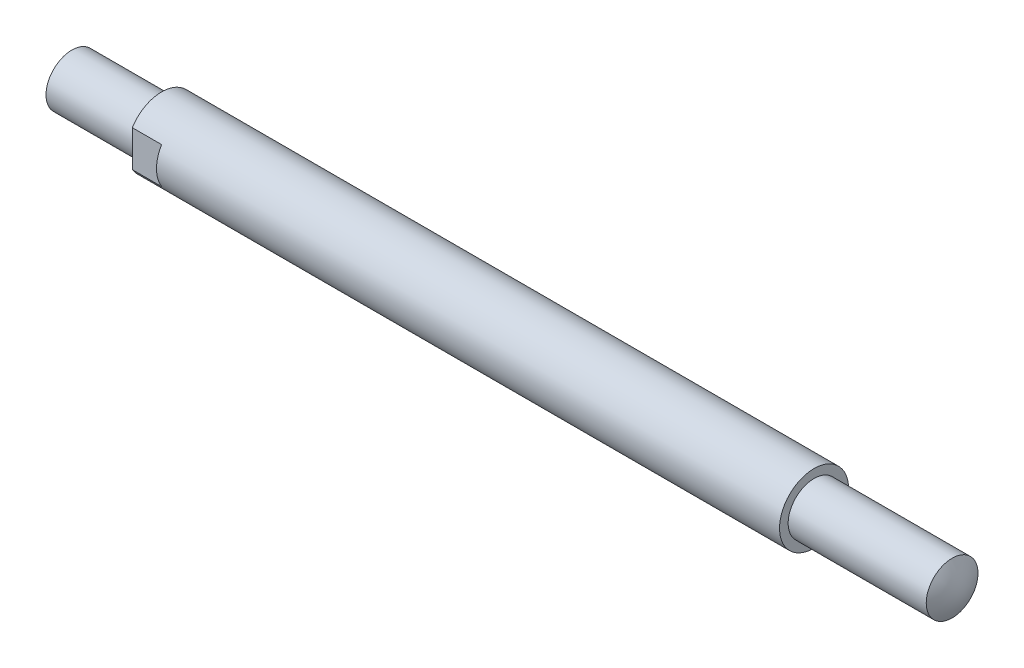
ISO-10303-21;
HEADER;
FILE_DESCRIPTION(('STEP AP214'),'2;1');
FILE_NAME('part.step','',(''),(''),'','','');
FILE_SCHEMA(('AUTOMOTIVE_DESIGN { 1 0 10303 214 1 1 1 1 }'));
ENDSEC;
DATA;
#1=APPLICATION_CONTEXT('core data for automotive mechanical design processes');
#2=APPLICATION_PROTOCOL_DEFINITION('international standard','automotive_design',2000,#1);
#3=PRODUCT_CONTEXT('',#1,'mechanical');
#4=PRODUCT('Part','Part','',(#3));
#5=PRODUCT_RELATED_PRODUCT_CATEGORY('part','',(#4));
#6=PRODUCT_DEFINITION_FORMATION('','',#4);
#7=PRODUCT_DEFINITION_CONTEXT('part definition',#1,'design');
#8=PRODUCT_DEFINITION('design','',#6,#7);
#9=PRODUCT_DEFINITION_SHAPE('','',#8);
#10=(LENGTH_UNIT() NAMED_UNIT(*) SI_UNIT(.MILLI.,.METRE.));
#11=(NAMED_UNIT(*) PLANE_ANGLE_UNIT() SI_UNIT($,.RADIAN.));
#12=(NAMED_UNIT(*) SI_UNIT($,.STERADIAN.) SOLID_ANGLE_UNIT());
#13=UNCERTAINTY_MEASURE_WITH_UNIT(LENGTH_MEASURE(1.E-05),#10,'distance_accuracy_value','');
#14=(GEOMETRIC_REPRESENTATION_CONTEXT(3) GLOBAL_UNCERTAINTY_ASSIGNED_CONTEXT((#13)) GLOBAL_UNIT_ASSIGNED_CONTEXT((#10,
#11,#12)) REPRESENTATION_CONTEXT('',''));
#15=CARTESIAN_POINT('',(0.,0.,0.));
#16=DIRECTION('',(0.,0.,1.));
#17=DIRECTION('',(1.,0.,0.));
#18=AXIS2_PLACEMENT_3D('',#15,#16,#17);
#19=CARTESIAN_POINT('',(0.,0.,0.));
#20=DIRECTION('',(1.,0.,0.));
#21=DIRECTION('',(0.,0.,-1.));
#22=AXIS2_PLACEMENT_3D('',#19,#20,#21);
#23=CYLINDRICAL_SURFACE('',#22,20.);
#24=CARTESIAN_POINT('',(52.,0.,0.));
#25=DIRECTION('',(1.,0.,0.));
#26=DIRECTION('',(0.,0.,-1.));
#27=AXIS2_PLACEMENT_3D('',#24,#25,#26);
#28=CIRCLE('',#27,20.);
#29=CARTESIAN_POINT('',(52.,-10.5356537528528,17.));
#30=VERTEX_POINT('',#29);
#31=CARTESIAN_POINT('',(52.,-10.5356537528527,-17.));
#32=VERTEX_POINT('',#31);
#33=EDGE_CURVE('E128',#30,#32,#28,.T.);
#34=ORIENTED_EDGE('',*,*,#33,.T.);
#35=DIRECTION('',(1.,0.,0.));
#36=VECTOR('',#35,1.);
#37=CARTESIAN_POINT('',(0.,-10.5356537528528,-17.));
#38=LINE('',#37,#36);
#39=CARTESIAN_POINT('',(69.,-10.5356537528528,-17.));
#40=VERTEX_POINT('',#39);
#41=EDGE_CURVE('E161',#32,#40,#38,.T.);
#42=ORIENTED_EDGE('',*,*,#41,.T.);
#43=CARTESIAN_POINT('',(69.,0.,0.));
#44=DIRECTION('',(-1.,0.,0.));
#45=DIRECTION('',(0.,0.,1.));
#46=AXIS2_PLACEMENT_3D('',#43,#44,#45);
#47=CIRCLE('',#46,20.);
#48=CARTESIAN_POINT('',(69.,10.5356537528528,-17.));
#49=VERTEX_POINT('',#48);
#50=EDGE_CURVE('E120',#40,#49,#47,.F.);
#51=ORIENTED_EDGE('',*,*,#50,.T.);
#52=DIRECTION('',(1.,0.,0.));
#53=VECTOR('',#52,1.);
#54=CARTESIAN_POINT('',(0.,10.5356537528528,-17.));
#55=LINE('',#54,#53);
#56=CARTESIAN_POINT('',(52.,10.5356537528527,-17.));
#57=VERTEX_POINT('',#56);
#58=EDGE_CURVE('E159',#49,#57,#55,.F.);
#59=ORIENTED_EDGE('',*,*,#58,.T.);
#60=CARTESIAN_POINT('',(52.,10.5356537528528,17.));
#61=VERTEX_POINT('',#60);
#62=EDGE_CURVE('E135',#57,#61,#28,.T.);
#63=ORIENTED_EDGE('',*,*,#62,.T.);
#64=DIRECTION('',(1.,0.,0.));
#65=VECTOR('',#64,1.);
#66=CARTESIAN_POINT('',(0.,10.5356537528528,17.));
#67=LINE('',#66,#65);
#68=CARTESIAN_POINT('',(69.,10.5356537528528,17.));
#69=VERTEX_POINT('',#68);
#70=EDGE_CURVE('E168',#61,#69,#67,.T.);
#71=ORIENTED_EDGE('',*,*,#70,.T.);
#72=CARTESIAN_POINT('',(69.,-10.5356537528528,17.));
#73=VERTEX_POINT('',#72);
#74=EDGE_CURVE('E13',#69,#73,#47,.F.);
#75=ORIENTED_EDGE('',*,*,#74,.T.);
#76=DIRECTION('',(1.,0.,0.));
#77=VECTOR('',#76,1.);
#78=CARTESIAN_POINT('',(0.,-10.5356537528528,17.));
#79=LINE('',#78,#77);
#80=EDGE_CURVE('E230',#73,#30,#79,.F.);
#81=ORIENTED_EDGE('',*,*,#80,.T.);
#82=EDGE_LOOP('',(#34,#42,#51,#59,#63,#71,#75,#81));
#83=FACE_BOUND('',#82,.T.);
#84=CARTESIAN_POINT('',(430.,0.,0.));
#85=DIRECTION('',(1.,0.,0.));
#86=DIRECTION('',(0.,0.,-1.));
#87=AXIS2_PLACEMENT_3D('',#84,#85,#86);
#88=CIRCLE('',#87,20.0000000000001);
#89=CARTESIAN_POINT('',(430.,0.,-20.0000000000001));
#90=VERTEX_POINT('',#89);
#91=EDGE_CURVE('E172',#90,#90,#88,.T.);
#92=ORIENTED_EDGE('',*,*,#91,.F.);
#93=EDGE_LOOP('',(#92));
#94=FACE_BOUND('',#93,.T.);
#95=ADVANCED_FACE('F104',(#83,#94),#23,.T.);
#96=CARTESIAN_POINT('',(52.,20.,0.));
#97=DIRECTION('',(-1.,0.,0.));
#98=DIRECTION('',(0.,0.,1.));
#99=AXIS2_PLACEMENT_3D('',#96,#97,#98);
#100=PLANE('',#99);
#101=CARTESIAN_POINT('',(52.,0.,0.));
#102=DIRECTION('',(1.,0.,0.));
#103=DIRECTION('',(0.,0.,-1.));
#104=AXIS2_PLACEMENT_3D('',#101,#102,#103);
#105=CIRCLE('',#104,15.);
#106=CARTESIAN_POINT('',(52.,0.,-15.));
#107=VERTEX_POINT('',#106);
#108=EDGE_CURVE('E177',#107,#107,#105,.T.);
#109=ORIENTED_EDGE('',*,*,#108,.T.);
#110=EDGE_LOOP('',(#109));
#111=FACE_BOUND('',#110,.T.);
#112=ORIENTED_EDGE('',*,*,#33,.F.);
#113=DIRECTION('',(0.,1.,0.));
#114=VECTOR('',#113,1.);
#115=CARTESIAN_POINT('',(52.,20.,17.));
#116=LINE('',#115,#114);
#117=EDGE_CURVE('E163',#30,#61,#116,.T.);
#118=ORIENTED_EDGE('',*,*,#117,.T.);
#119=ORIENTED_EDGE('',*,*,#62,.F.);
#120=DIRECTION('',(0.,-1.,0.));
#121=VECTOR('',#120,1.);
#122=CARTESIAN_POINT('',(52.,20.,-17.));
#123=LINE('',#122,#121);
#124=EDGE_CURVE('E156',#57,#32,#123,.T.);
#125=ORIENTED_EDGE('',*,*,#124,.T.);
#126=EDGE_LOOP('',(#112,#118,#119,#125));
#127=FACE_BOUND('',#126,.T.);
#128=ADVANCED_FACE('F171',(#111,#127),#100,.T.);
#129=CARTESIAN_POINT('',(506.003460721565,15.5059468598419,-15.5299512966578));
#130=CARTESIAN_POINT('',(508.510380165606,9.32761405926904,-15.5299512966578));
#131=CARTESIAN_POINT('',(510.649872528677,3.14928125869615,-15.5299512966578));
#132=CARTESIAN_POINT('',(510.690945581682,-3.02905154187674,-15.5299512966578));
#133=CARTESIAN_POINT('',(508.554336804475,-9.2073843424496,-15.5299512966578));
#134=CARTESIAN_POINT('',(505.985256529258,-15.3857171430225,-15.5299512966578));
#135=CARTESIAN_POINT('',(508.533016073227,15.5059468598419,-9.3311533509139));
#136=CARTESIAN_POINT('',(511.479776545677,9.32761405926902,-9.3311533509139));
#137=CARTESIAN_POINT('',(514.31880844939,3.14928125869612,-9.3311533509139));
#138=CARTESIAN_POINT('',(514.39235412393,-3.02905154187676,-9.3311533509139));
#139=CARTESIAN_POINT('',(511.565569706442,-9.20738434244962,-9.3311533509139));
#140=CARTESIAN_POINT('',(508.570988412591,-15.3857171430225,-9.3311533509139));
#141=CARTESIAN_POINT('',(510.67652886431,15.5059468598419,-3.13235540516998));
#142=CARTESIAN_POINT('',(514.321277594549,9.327614059269,-3.13235540516997));
#143=CARTESIAN_POINT('',(517.970062646521,3.14928125869609,-3.13235540516998));
#144=CARTESIAN_POINT('',(518.072751997051,-3.02905154187679,-3.13235540516997));
#145=CARTESIAN_POINT('',(514.457278711764,-9.20738434244965,-3.13235540516998));
#146=CARTESIAN_POINT('',(510.758280108599,-15.3857171430225,-3.13235540516998));
#147=CARTESIAN_POINT('',(510.699473093552,15.5059468598419,3.06644254057395));
#148=CARTESIAN_POINT('',(514.351442665554,9.327614059269,3.06644254057394));
#149=CARTESIAN_POINT('',(518.037439853943,3.14928125869609,3.06644254057395));
#150=CARTESIAN_POINT('',(518.143550381017,-3.02905154187679,3.06644254057394));
#151=CARTESIAN_POINT('',(514.486706585811,-9.20738434244965,3.06644254057395));
#152=CARTESIAN_POINT('',(510.781993088006,-15.3857171430225,3.06644254057395));
#153=CARTESIAN_POINT('',(508.557805894513,15.5059468598419,9.26524048631787));
#154=CARTESIAN_POINT('',(511.531916569572,9.32761405926902,9.26524048631787));
#155=CARTESIAN_POINT('',(514.386604159846,3.14928125869612,9.26524048631787));
#156=CARTESIAN_POINT('',(514.46032875222,-3.02905154187676,9.26524048631787));
#157=CARTESIAN_POINT('',(511.619019722273,-9.20738434244962,9.26524048631787));
#158=CARTESIAN_POINT('',(508.596532801838,-15.3857171430225,9.26524048631787));
#159=CARTESIAN_POINT('',(505.992208009904,15.5059468598419,15.4640384320618));
#160=CARTESIAN_POINT('',(508.528942767858,9.32761405926904,15.4640384320618));
#161=CARTESIAN_POINT('',(510.696356511559,3.14928125869615,15.4640384320618));
#162=CARTESIAN_POINT('',(510.737951916131,-3.02905154187674,15.4640384320618));
#163=CARTESIAN_POINT('',(508.573826094818,-9.2073843424496,15.4640384320618));
#164=CARTESIAN_POINT('',(505.974647044061,-15.3857171430225,15.4640384320618));
#165=B_SPLINE_SURFACE_WITH_KNOTS('',5,5,((#129,#130,#131,#132,#133,#134),(#135,#136,#137,#138,
#139,#140),(#141,#142,#143,#144,#145,#146),(#147,#148,#149,#150,#151,#152),(#153,#154,#155,#156,
#157,#158),(#159,#160,#161,#162,#163,#164)),.UNSPECIFIED.,.F.,.F.,.F.,(6,6),(6,6),
(-14.8156655821278,16.1783241465919),(-15.5059468598419,15.3857171430225),.UNSPECIFIED.);
#166=CARTESIAN_POINT('',(510.000496568832,-1.31570145403548E-09,15.));
#167=CARTESIAN_POINT('',(510.000495782168,-0.421429776869079,15.0000030242873));
#168=CARTESIAN_POINT('',(510.000450512711,-0.842809923144413,14.9822323929808));
#169=CARTESIAN_POINT('',(510.000293100361,-1.68271575973997,14.9112739255239));
#170=CARTESIAN_POINT('',(510.000180939876,-2.10124066985293,14.858076771977));
#171=CARTESIAN_POINT('',(509.999941224686,-2.93276539985645,14.7165539633599));
#172=CARTESIAN_POINT('',(509.999813653539,-3.34575878690115,14.628190553682));
#173=CARTESIAN_POINT('',(509.999603605112,-4.16282768385486,14.4169661718588));
#174=CARTESIAN_POINT('',(509.999521127667,-4.5669032260511,14.2941053246342));
#175=CARTESIAN_POINT('',(509.99944253143,-5.36306649444973,14.0148279189499));
#176=CARTESIAN_POINT('',(509.999446370848,-5.75515992951628,13.8584276343539));
#177=CARTESIAN_POINT('',(509.999543787928,-6.52478193673851,13.5131457176007));
#178=CARTESIAN_POINT('',(509.999637367008,-6.90231027868234,13.3242635723015));
#179=CARTESIAN_POINT('',(509.999877918974,-7.6400164834715,12.9154150147954));
#180=CARTESIAN_POINT('',(510.000024878246,-8.00019874346059,12.695456536489));
#181=CARTESIAN_POINT('',(510.000311713865,-8.7007543682273,12.2259833328527));
#182=CARTESIAN_POINT('',(510.000451590241,-9.04112781053462,11.9764687232142));
#183=CARTESIAN_POINT('',(510.000665885931,-9.699682991689,11.449628059589));
#184=CARTESIAN_POINT('',(510.000740298305,-10.0178623745999,11.1722990606532));
#185=CARTESIAN_POINT('',(510.00079272345,-10.629728114431,10.5918229523592));
#186=CARTESIAN_POINT('',(510.000770736122,-10.9234144466755,10.288675816991));
#187=CARTESIAN_POINT('',(510.000640247796,-11.4842168001909,9.65870651515304));
#188=CARTESIAN_POINT('',(510.000531743429,-11.75133178657,9.33188342741649));
#189=CARTESIAN_POINT('',(510.000274368157,-12.2570793034053,8.65689632371608));
#190=CARTESIAN_POINT('',(510.000125497259,-12.4957118391047,8.30873231168075));
#191=CARTESIAN_POINT('',(509.999849517643,-12.9427935954912,7.59354555201252));
#192=CARTESIAN_POINT('',(509.999722408503,-13.1512434009711,7.22652316994863));
#193=CARTESIAN_POINT('',(509.999541059274,-13.5364832538559,6.47622275914334));
#194=CARTESIAN_POINT('',(509.999486819184,-13.7132733011784,6.09294473035961));
#195=CARTESIAN_POINT('',(509.999469505286,-14.0339364308345,5.31285870857865));
#196=CARTESIAN_POINT('',(509.999506431293,-14.1778095799308,4.91605074302493));
#197=CARTESIAN_POINT('',(509.99964977733,-14.4316165244403,4.11172517236712));
#198=CARTESIAN_POINT('',(509.999756197361,-14.5415503193728,3.70420756711135));
#199=CARTESIAN_POINT('',(509.999987296172,-14.7266971737909,2.88135912672158));
#200=CARTESIAN_POINT('',(510.000111974986,-14.8019101675327,2.46602827679474));
#201=CARTESIAN_POINT('',(510.000321946595,-14.9170803954478,1.63050683442831));
#202=CARTESIAN_POINT('',(510.00040723939,-14.9570376300679,1.21031624205031));
#203=CARTESIAN_POINT('',(510.000499980171,-15.0014122262983,0.368063371225103));
#204=CARTESIAN_POINT('',(510.000507428299,-15.0058296520966,-0.0539989038403074));
#205=CARTESIAN_POINT('',(510.000442029274,-14.9790933935277,-0.89699528541269));
#206=CARTESIAN_POINT('',(510.000369182121,-14.947939708907,-1.31792939191162));
#207=CARTESIAN_POINT('',(510.000177586901,-14.8502826752609,-2.15567719831753));
#208=CARTESIAN_POINT('',(510.000058838797,-14.7837792972272,-2.57249089484298));
#209=CARTESIAN_POINT('',(509.999831386751,-14.6158956555096,-3.39903425987463));
#210=CARTESIAN_POINT('',(509.999722682809,-14.5145153918561,-3.80876392838702));
#211=CARTESIAN_POINT('',(509.999568233754,-14.2775986003683,-4.61822674793146));
#212=CARTESIAN_POINT('',(509.999522488706,-14.1420620368804,-5.01795988852829));
#213=CARTESIAN_POINT('',(509.999520719655,-13.8377962831581,-5.80458733431049));
#214=CARTESIAN_POINT('',(509.999564695652,-13.6690670930451,-6.19148163954285));
#215=CARTESIAN_POINT('',(509.999731246348,-13.2996156849929,-6.94968076024351));
#216=CARTESIAN_POINT('',(509.999853821035,-13.0988934718615,-7.32098557805453));
#217=CARTESIAN_POINT('',(510.000133089784,-12.6668830116574,-8.04536604493487));
#218=CARTESIAN_POINT('',(510.000289783847,-12.4355947642874,-8.39844169382688));
#219=CARTESIAN_POINT('',(510.000578064608,-11.9440966460005,-9.08385354275871));
#220=CARTESIAN_POINT('',(510.000709651317,-11.6838867871645,-9.41618975146153));
#221=CARTESIAN_POINT('',(510.000898298053,-11.1363952937417,-10.0577601752451));
#222=CARTESIAN_POINT('',(510.000955358079,-10.8491136595269,-10.3669943906432));
#223=CARTESIAN_POINT('',(510.000975344769,-10.2495208144079,-10.9601625538559));
#224=CARTESIAN_POINT('',(510.000938271368,-9.93720958663945,-11.2440964846233));
#225=CARTESIAN_POINT('',(510.000787323274,-9.28977807669831,-11.7846452394455));
#226=CARTESIAN_POINT('',(510.000673448579,-8.95465779420935,-12.0412600631214));
#227=CARTESIAN_POINT('',(510.000414741853,-8.26399062395911,-12.5253462684726));
#228=CARTESIAN_POINT('',(510.000269909816,-7.90844373295149,-12.7528176455162));
#229=CARTESIAN_POINT('',(510.000003650543,-7.17945110444733,-13.1769997347818));
#230=CARTESIAN_POINT('',(509.999882223305,-6.80600536710162,-13.373710447263));
#231=CARTESIAN_POINT('',(509.999702893089,-6.04387006453483,-13.7349726891682));
#232=CARTESIAN_POINT('',(509.999644990101,-5.65518050153236,-13.8995242232727));
#233=CARTESIAN_POINT('',(509.999602813841,-4.86532085200752,-14.1952982760807));
#234=CARTESIAN_POINT('',(509.99961854057,-4.46415076544377,-14.3265207946738));
#235=CARTESIAN_POINT('',(509.999701465445,-3.65218217173066,-14.5547038963421));
#236=CARTESIAN_POINT('',(509.99976866359,-3.24138366496137,-14.6516644807698));
#237=CARTESIAN_POINT('',(509.999911955852,-2.41307873900609,-14.8106343929116));
#238=CARTESIAN_POINT('',(509.999988049968,-1.99557231981585,-14.8726437206035));
#239=CARTESIAN_POINT('',(510.000106559908,-1.15681984449906,-14.9612702640277));
#240=CARTESIAN_POINT('',(510.000148975737,-0.735573788956972,-14.9878874852911));
#241=CARTESIAN_POINT('',(510.000177389449,0.10766321599408,-15.0055406000806));
#242=CARTESIAN_POINT('',(510.000163387332,0.529654165400681,-14.9965764937196));
#243=CARTESIAN_POINT('',(510.000086520521,1.37138087016554,-14.9431306824296));
#244=CARTESIAN_POINT('',(510.000023655825,1.79111662543291,-14.8986489760691));
#245=CARTESIAN_POINT('',(509.999883393547,2.62534886388983,-14.7744842016327));
#246=CARTESIAN_POINT('',(509.999805995966,3.03984534705022,-14.6948011333608));
#247=CARTESIAN_POINT('',(509.999681834796,3.8606523673397,-14.5008000985664));
#248=CARTESIAN_POINT('',(509.999635071217,4.26696290172348,-14.3864821204287));
#249=CARTESIAN_POINT('',(509.999606888594,5.0685092527236,-14.1240240071999));
#250=CARTESIAN_POINT('',(509.999625469548,5.46374506943249,-13.9758838723915));
#251=CARTESIAN_POINT('',(509.999735073728,6.240332041305,-13.646834657578));
#252=CARTESIAN_POINT('',(509.999826096945,6.62168319814964,-13.4659255815402));
#253=CARTESIAN_POINT('',(510.000054841145,7.36778972678952,-13.0726246290949));
#254=CARTESIAN_POINT('',(510.000192562129,7.73254509841001,-12.8602327523558));
#255=CARTESIAN_POINT('',(510.000465462221,8.44286662991595,-12.4054763297013));
#256=CARTESIAN_POINT('',(510.000600641331,8.7884328031267,-12.1631118045997));
#257=CARTESIAN_POINT('',(510.000815917578,9.45791945564833,-11.6501330236194));
#258=CARTESIAN_POINT('',(510.000896014716,9.78183993522586,-11.3795187680888));
#259=CARTESIAN_POINT('',(510.000967743036,10.4057324438237,-10.811964315307));
#260=CARTESIAN_POINT('',(510.000959374184,10.7057044634857,-10.5150241077686));
#261=CARTESIAN_POINT('',(510.000854888972,11.2795672812808,-9.89692891757377));
#262=CARTESIAN_POINT('',(510.000758772612,11.5534580791856,-9.57577393470545));
#263=CARTESIAN_POINT('',(510.000514338933,12.0732111484605,-8.91153255400209));
#264=CARTESIAN_POINT('',(510.000366021635,12.3190734312243,-8.5684461650824));
#265=CARTESIAN_POINT('',(510.000073411925,12.7810216817727,-7.86278097468131));
#266=CARTESIAN_POINT('',(509.999929119512,12.9971076496474,-7.50020217325885));
#267=CARTESIAN_POINT('',(509.999698255497,13.3979668240505,-6.75813025125523));
#268=CARTESIAN_POINT('',(509.999611683833,13.5827400641289,-6.37863714879741));
#269=CARTESIAN_POINT('',(509.999525025022,13.9196604357371,-5.6054342271989));
#270=CARTESIAN_POINT('',(509.999524937874,14.071807567448,-5.21172440813714));
#271=CARTESIAN_POINT('',(509.999603180308,14.3423941139983,-4.412886898617));
#272=CARTESIAN_POINT('',(509.999681509929,14.4608335120972,-4.00775920248817));
#273=CARTESIAN_POINT('',(509.999875567466,14.6631624642494,-3.18896632859569));
#274=CARTESIAN_POINT('',(509.999991295383,14.7470520178933,-2.77530115073084));
#275=CARTESIAN_POINT('',(510.000204320831,14.8796850008568,-1.94237344824624));
#276=CARTESIAN_POINT('',(510.000301618329,14.9284283664829,-1.5231109134841));
#277=CARTESIAN_POINT('',(510.000431767293,14.9904221870316,-0.681969936841834));
#278=CARTESIAN_POINT('',(510.000464618761,15.0036726423846,-0.260091494993431));
#279=CARTESIAN_POINT('',(510.000450060028,14.9945864454591,0.583281375101778));
#280=CARTESIAN_POINT('',(510.000402649943,14.9722498445521,1.00477580390205));
#281=CARTESIAN_POINT('',(510.00024909389,14.8921484331079,1.84438468882242));
#282=CARTESIAN_POINT('',(510.000142947922,14.8343836220447,2.26249914489233));
#283=CARTESIAN_POINT('',(509.99992138757,14.6838363105082,3.09237639179817));
#284=CARTESIAN_POINT('',(509.999805973169,14.5910537393596,3.50413916981293));
#285=CARTESIAN_POINT('',(509.999621305243,14.3711305472891,4.3183848056189));
#286=CARTESIAN_POINT('',(509.999552051716,14.2439899274296,4.72086766369708));
#287=CARTESIAN_POINT('',(509.999496112815,13.9562518490919,5.51369943734836));
#288=CARTESIAN_POINT('',(509.999509428977,13.7956537679761,5.90404812695131));
#289=CARTESIAN_POINT('',(509.999619088272,13.4421439698432,6.66982853832799));
#290=CARTESIAN_POINT('',(509.999715431423,13.2492322462101,7.04526025704756));
#291=CARTESIAN_POINT('',(509.99995441308,12.8324748533716,7.77852315920301));
#292=CARTESIAN_POINT('',(510.000097049785,12.6086303881585,8.13635502694163));
#293=CARTESIAN_POINT('',(510.000369997701,12.1315933669637,8.83188968329564));
#294=CARTESIAN_POINT('',(510.000500308924,11.8784008408227,9.16959249237739));
#295=CARTESIAN_POINT('',(510.0006933482,11.3444959570048,9.82243384288976));
#296=CARTESIAN_POINT('',(510.000756083454,11.0637865347708,10.1375747849786));
#297=CARTESIAN_POINT('',(510.000786352805,10.4768193224881,10.7430932910728));
#298=CARTESIAN_POINT('',(510.00075388653,10.1705614326079,11.033470758305));
#299=CARTESIAN_POINT('',(510.000606114518,9.53459380052233,11.5874677113883));
#300=CARTESIAN_POINT('',(510.000490787663,9.20487809951162,11.8510803568078));
#301=CARTESIAN_POINT('',(510.000224742064,8.5244143789643,12.349584679771));
#302=CARTESIAN_POINT('',(510.000074023878,8.17366669140515,12.5844768104733));
#303=CARTESIAN_POINT('',(509.999799267841,7.45345349370539,13.023981064997));
#304=CARTESIAN_POINT('',(509.999675242927,7.08397901480491,13.2285784923822));
#305=CARTESIAN_POINT('',(509.999503891636,6.32909940222618,13.6059017034148));
#306=CARTESIAN_POINT('',(509.999456565535,5.94369421106865,13.7786273720541));
#307=CARTESIAN_POINT('',(509.999454530555,5.16011071944589,14.0908095850588));
#308=CARTESIAN_POINT('',(509.999499722133,4.76194660044433,14.2303017061891));
#309=CARTESIAN_POINT('',(509.999657878446,3.95541951906799,14.4752296062212));
#310=CARTESIAN_POINT('',(509.999770825353,3.54705926671651,14.5806743329027));
#311=CARTESIAN_POINT('',(510.000040213952,2.62023991534775,14.7787428493112));
#312=CARTESIAN_POINT('',(510.000200484451,2.09967450591842,14.861643863909));
#313=CARTESIAN_POINT('',(510.000429153118,1.0527135945674,14.9722705501253));
#314=CARTESIAN_POINT('',(510.000497551288,0.526318092779256,14.9999962230076));
#315=CARTESIAN_POINT('',(510.000496568832,-1.31570145403548E-09,15.));
#316=B_SPLINE_CURVE_WITH_KNOTS('',3,(#166,#167,#168,#169,#170,#171,#172,#173,#174,#175,#176,
#177,#178,#179,#180,#181,#182,#183,#184,#185,#186,#187,#188,#189,#190,#191,#192,#193,#194,#195,
#196,#197,#198,#199,#200,#201,#202,#203,#204,#205,#206,#207,#208,#209,#210,#211,#212,#213,#214,
#215,#216,#217,#218,#219,#220,#221,#222,#223,#224,#225,#226,#227,#228,#229,#230,#231,#232,#233,
#234,#235,#236,#237,#238,#239,#240,#241,#242,#243,#244,#245,#246,#247,#248,#249,#250,#251,#252,
#253,#254,#255,#256,#257,#258,#259,#260,#261,#262,#263,#264,#265,#266,#267,#268,#269,#270,#271,
#272,#273,#274,#275,#276,#277,#278,#279,#280,#281,#282,#283,#284,#285,#286,#287,#288,#289,#290,
#291,#292,#293,#294,#295,#296,#297,#298,#299,#300,#301,#302,#303,#304,#305,#306,#307,#308,#309,
#310,#311,#312,#313,#314,#315),.UNSPECIFIED.,.T.,.F.,(4,2,2,2,2,2,2,2,2,2,2,2,2,2,2,2,2,2,2,2,2,
2,2,2,2,2,2,2,2,2,2,2,2,2,2,2,2,2,2,2,2,2,2,2,2,2,2,2,2,2,2,2,2,2,2,2,2,2,2,2,2,2,2,2,2,2,2,2,2,
2,2,2,2,2,4),(0.,1.26382958854519,2.52799170350713,3.79351470426992,5.05903312242915,
6.32393887489262,7.58886461192347,8.85346799043871,10.1180664190913,11.3827988833182,
12.6475326216952,13.9123155992231,15.1770983439246,16.4418565800875,17.7066148195441,
18.9713704937743,20.236126185917,21.5008842728642,22.7656423437809,24.030398130434,
25.2951539261045,26.5599107596503,27.8246675920909,29.0894257447363,30.354183892754,
31.6189418507084,32.8836998209647,34.1484572629189,35.4132146874929,36.6779729642397,
37.9427312585242,39.2074897538127,40.4722482384426,41.7370065389983,43.0017648437466,
44.2665230985705,45.5312813541981,46.7960394121635,48.0607974661169,49.3255555710453,
50.5903136830156,51.8550722191373,53.1198307446906,54.3845891171197,55.6493475028662,
56.9141050103319,58.1788625022166,59.4436204883297,60.7083784855156,61.973135968568,
63.2378934477963,64.5026495718933,65.7674056889681,67.0321624341686,68.2969191943612,
69.5616782466006,70.8264372835034,72.0911944946707,73.3559517246169,74.6207115072016,
75.8854712506753,77.1502545332091,78.4150380746979,79.679772400989,80.9445054413312,
82.2091037092166,83.4737069187957,84.7386325206267,86.0035381616084,87.2690554318008,
88.5345772684803,89.7987382051658,91.0625666448268,92.6409468023905,94.219326923801),.UNSPECIFIED.);
#317=CARTESIAN_POINT('',(510.000496568832,-1.31570145403548E-09,15.));
#318=VERTEX_POINT('',#317);
#319=EDGE_CURVE('E164',#318,#318,#316,.T.);
#320=ORIENTED_EDGE('',*,*,#319,.T.);
#321=EDGE_LOOP('',(#320));
#322=FACE_BOUND('',#321,.T.);
#323=ADVANCED_FACE('F188',(#322),#165,.T.);
#324=CARTESIAN_POINT('',(0.,0.,0.));
#325=DIRECTION('',(1.,0.,0.));
#326=DIRECTION('',(0.,0.,-1.));
#327=AXIS2_PLACEMENT_3D('',#324,#325,#326);
#328=CYLINDRICAL_SURFACE('',#327,15.0000000000001);
#329=CARTESIAN_POINT('',(430.,0.,0.));
#330=DIRECTION('',(1.,0.,0.));
#331=DIRECTION('',(0.,0.,-1.));
#332=AXIS2_PLACEMENT_3D('',#329,#330,#331);
#333=CIRCLE('',#332,15.0000000000001);
#334=CARTESIAN_POINT('',(430.,0.,-15.0000000000001));
#335=VERTEX_POINT('',#334);
#336=EDGE_CURVE('E175',#335,#335,#333,.T.);
#337=ORIENTED_EDGE('',*,*,#336,.T.);
#338=EDGE_LOOP('',(#337));
#339=FACE_BOUND('',#338,.T.);
#340=ORIENTED_EDGE('',*,*,#319,.F.);
#341=EDGE_LOOP('',(#340));
#342=FACE_BOUND('',#341,.T.);
#343=ADVANCED_FACE('F192',(#339,#342),#328,.T.);
#344=CARTESIAN_POINT('',(430.,15.0000000000001,0.));
#345=DIRECTION('',(1.,0.,0.));
#346=DIRECTION('',(0.,0.,-1.));
#347=AXIS2_PLACEMENT_3D('',#344,#345,#346);
#348=PLANE('',#347);
#349=ORIENTED_EDGE('',*,*,#91,.T.);
#350=EDGE_LOOP('',(#349));
#351=FACE_BOUND('',#350,.T.);
#352=ORIENTED_EDGE('',*,*,#336,.F.);
#353=EDGE_LOOP('',(#352));
#354=FACE_BOUND('',#353,.T.);
#355=ADVANCED_FACE('F196',(#351,#354),#348,.T.);
#356=CARTESIAN_POINT('',(0.,0.,0.));
#357=DIRECTION('',(1.,0.,0.));
#358=DIRECTION('',(0.,0.,-1.));
#359=AXIS2_PLACEMENT_3D('',#356,#357,#358);
#360=CYLINDRICAL_SURFACE('',#359,15.);
#361=CARTESIAN_POINT('',(-0.000496568833336055,1.31570644136547E-09,15.));
#362=CARTESIAN_POINT('',(-0.000498013455192686,-0.42142977631333,15.0000030243559));
#363=CARTESIAN_POINT('',(-0.000454975977635586,-0.842809924955228,14.9822323929468));
#364=CARTESIAN_POINT('',(-0.000301156707320572,-1.68271576629595,14.9112739248509));
#365=CARTESIAN_POINT('',(-0.000190357093335825,-2.10124067878806,14.8580767707736));
#366=CARTESIAN_POINT('',(4.81310064600834E-05,-2.93276541355382,14.7165539607108));
#367=CARTESIAN_POINT('',(0.000175837544964798,-3.34575880297308,14.6281905500707));
#368=CARTESIAN_POINT('',(0.000387807751565322,-4.16282770425,14.4169661660428));
#369=CARTESIAN_POINT('',(0.000472071576962319,-4.56690324839311,14.2941053175688));
#370=CARTESIAN_POINT('',(0.000555427911147814,-5.36306652040001,14.0148279090757));
#371=CARTESIAN_POINT('',(0.000554561633623339,-5.75515995714202,13.858427622961));
#372=CARTESIAN_POINT('',(0.000463237391285651,-6.52478196791681,13.5131457026117));
#373=CARTESIAN_POINT('',(0.000372778011048541,-6.90231031174713,13.324263555256));
#374=CARTESIAN_POINT('',(0.000137266805252818,-7.64001652037686,12.9154149930625));
#375=CARTESIAN_POINT('',(-7.77110194002138E-06,-8.00019878230218,12.695456512093));
#376=CARTESIAN_POINT('',(-0.000293124666544528,-8.70075441005672,12.2259833031874));
#377=CARTESIAN_POINT('',(-0.000433440342434422,-9.04112785340222,11.9764686909225));
#378=CARTESIAN_POINT('',(-0.000651426280017326,-9.69968302785586,11.4496280286532));
#379=CARTESIAN_POINT('',(-0.000729089901837166,-10.0178624035702,11.1722990343778));
#380=CARTESIAN_POINT('',(-0.000790226969750521,-10.6297281304451,10.5918229359578));
#381=CARTESIAN_POINT('',(-0.000773700320991379,-10.9234144569401,10.2886758058138));
#382=CARTESIAN_POINT('',(-0.000654743833879721,-11.4842168004269,9.65870651453433));
#383=CARTESIAN_POINT('',(-0.000552310651237036,-11.7513317825593,9.33188343216067));
#384=CARTESIAN_POINT('',(-0.00030559630746754,-12.2570792918187,8.65689633978836));
#385=CARTESIAN_POINT('',(-0.000161315154047913,-12.4957118241913,8.30873233372009));
#386=CARTESIAN_POINT('',(0.000108763662148932,-12.9427935834953,7.59354557301926));
#387=CARTESIAN_POINT('',(0.00023456168227827,-13.151243393977,7.22652318317911));
#388=CARTESIAN_POINT('',(0.00041732430452651,-13.5364832553328,6.47622275665799));
#389=CARTESIAN_POINT('',(0.000474288906414394,-13.7132733061007,6.09294471992246));
#390=CARTESIAN_POINT('',(0.000500437627020779,-14.033936441541,5.31285868099493));
#391=CARTESIAN_POINT('',(0.000469621923816131,-14.1778095929903,4.91605070625226));
#392=CARTESIAN_POINT('',(0.000340020057157768,-14.4316165408489,4.11172511575412));
#393=CARTESIAN_POINT('',(0.0002412338928109,-14.5415503368123,3.70420749985791));
#394=CARTESIAN_POINT('',(2.45406030329271E-05,-14.7266972010593,2.88135899527917));
#395=CARTESIAN_POINT('',(-9.33665605812152E-05,-14.8019102000072,2.46602809099561));
#396=CARTESIAN_POINT('',(-0.000292674324931151,-14.9170804291529,1.63050654011548));
#397=CARTESIAN_POINT('',(-0.000374074926087621,-14.957037659757,1.21031589357491));
#398=CARTESIAN_POINT('',(-0.000462841258033079,-15.0014122389958,0.368062915179212));
#399=CARTESIAN_POINT('',(-0.000470207122433138,-15.0058296517695,-0.0539994132966986));
#400=CARTESIAN_POINT('',(-0.000408039049734583,-14.9790933581914,-0.896995900422865));
#401=CARTESIAN_POINT('',(-0.000338505112145972,-14.947939651613,-1.31793005906593));
#402=CARTESIAN_POINT('',(-0.000155444282357573,-14.8502825654399,-2.15567796475305));
#403=CARTESIAN_POINT('',(-4.19173543988103E-05,-14.7837791571118,-2.5724917084476));
#404=CARTESIAN_POINT('',(0.000175103504708729,-14.6158954467269,-3.39903516400318));
#405=CARTESIAN_POINT('',(0.000278597435864085,-14.514515144693,-3.80876487586886));
#406=CARTESIAN_POINT('',(0.000424272728356479,-14.2775982691281,-4.61822777665343));
#407=CARTESIAN_POINT('',(0.000466454025646467,-14.1420616599178,-5.01796095512954));
#408=CARTESIAN_POINT('',(0.000463587278484246,-13.8377958080491,-5.80458847059527));
#409=CARTESIAN_POINT('',(0.000418539234335416,-13.6690665655062,-6.19148280762954));
#410=CARTESIAN_POINT('',(0.000252248839056241,-13.2996150587057,-6.94968196007256));
#411=CARTESIAN_POINT('',(0.000131006504565335,-13.0988928014347,-7.32098677888574));
#412=CARTESIAN_POINT('',(-0.000144012803683367,-12.6668822511283,-8.04536724348146));
#413=CARTESIAN_POINT('',(-0.000297789777739531,-12.4355939578126,-8.39844288909681));
#414=CARTESIAN_POINT('',(-0.000579805440279387,-11.9440957468609,-9.08385472602916));
#415=CARTESIAN_POINT('',(-0.000708044139457994,-11.6838858413367,-9.41619092603139));
#416=CARTESIAN_POINT('',(-0.000890637602017159,-11.1363942544835,-10.0577613268707));
#417=CARTESIAN_POINT('',(-0.000944992366379296,-10.8491125735142,-10.3669955280147));
#418=CARTESIAN_POINT('',(-0.000960910075529623,-10.2495196483506,-10.9601636444229));
#419=CARTESIAN_POINT('',(-0.000922472961784042,-9.93720838836775,-11.2440975437275));
#420=CARTESIAN_POINT('',(-0.00077034103906618,-9.28977681655979,-11.7846462328987));
#421=CARTESIAN_POINT('',(-0.000656646229074474,-8.95465650442574,-12.0412610223953));
#422=CARTESIAN_POINT('',(-0.000399582406851101,-8.26398927776598,-12.5253471567452));
#423=CARTESIAN_POINT('',(-0.000256213389943891,-7.90844236002181,-12.7528184970064));
#424=CARTESIAN_POINT('',(6.41928550480832E-06,-7.17944968099821,-13.1770005104322));
#425=CARTESIAN_POINT('',(0.000125682944248898,-6.80600391986921,-13.3737111838551));
#426=CARTESIAN_POINT('',(0.00030069574108704,-6.04386856556455,-13.734973349115));
#427=CARTESIAN_POINT('',(0.000356444887127691,-5.65517897429613,-13.8995248449754));
#428=CARTESIAN_POINT('',(0.00039495666341449,-4.86531927156968,-14.1952988180899));
#429=CARTESIAN_POINT('',(0.000377719293405728,-4.46414916006806,-14.3265212952276));
#430=CARTESIAN_POINT('',(0.000292798702520714,-3.65218051978018,-14.5547043111766));
#431=CARTESIAN_POINT('',(0.00022511548362692,-3.24138199137229,-14.6516648513344));
#432=CARTESIAN_POINT('',(8.19066244729333E-05,-2.41307702569257,-14.8106346723677));
#433=CARTESIAN_POINT('',(6.38098420967292E-06,-1.9955705884181,-14.8726439532296));
#434=CARTESIAN_POINT('',(-0.000110264592563048,-1.15681808270287,-14.9612704005086));
#435=CARTESIAN_POINT('',(-0.000151384534601478,-0.735572014863083,-14.9878875726132));
#436=CARTESIAN_POINT('',(-0.000177048600912848,0.107665010364828,-15.0055405874638));
#437=CARTESIAN_POINT('',(-0.000161592725353182,0.529655967750744,-14.9965764303152));
#438=CARTESIAN_POINT('',(-8.22829070634503E-05,1.37138268385115,-14.9431305162319));
#439=CARTESIAN_POINT('',(-1.84289623970588E-05,1.79111844247542,-14.8986487578762));
#440=CARTESIAN_POINT('',(0.000122880358578904,2.62535068321049,-14.7744838785992));
#441=CARTESIAN_POINT('',(0.000200335734961953,3.03984716529299,-14.6948007574876));
#442=CARTESIAN_POINT('',(0.000323526073926632,3.86065417279239,-14.5007996179643));
#443=CARTESIAN_POINT('',(0.000369261026344163,4.26696469558626,-14.3864815884546));
#444=CARTESIAN_POINT('',(0.00039451345023772,5.06851101884822,-14.1240233734924));
#445=CARTESIAN_POINT('',(0.000374030922266723,5.46374681940882,-13.9758831883223));
#446=CARTESIAN_POINT('',(0.000260277776708776,6.24033375442747,-13.6468338742903));
#447=CARTESIAN_POINT('',(0.000167007167912697,6.62168489056242,-13.4659247493861));
#448=CARTESIAN_POINT('',(-6.58808284033506E-05,7.36779137358763,-13.0726237010244));
#449=CARTESIAN_POINT('',(-0.000205498216418683,7.73254672030049,-12.8602317772304));
#450=CARTESIAN_POINT('',(-0.000481168273714386,8.44286819309811,-12.4054752657044));
#451=CARTESIAN_POINT('',(-0.000617220945522568,8.78843433279049,-12.1631106992272));
#452=CARTESIAN_POINT('',(-0.000832779095785329,9.45792091532067,-11.6501318384813));
#453=CARTESIAN_POINT('',(-0.000912284574957572,9.78184135843317,-11.379517544571));
#454=CARTESIAN_POINT('',(-0.000981324638441921,10.4057337911504,-10.811963018472));
#455=CARTESIAN_POINT('',(-0.000970859187575023,10.7057057713911,-10.5150227759898));
#456=CARTESIAN_POINT('',(-0.000861132601882946,11.279568507395,-9.89692752001439));
#457=CARTESIAN_POINT('',(-0.000761871466249122,11.5534592629207,-9.57577250630075));
#458=CARTESIAN_POINT('',(-0.000511014021944525,12.0732122321158,-8.91153108469456));
#459=CARTESIAN_POINT('',(-0.000359417737143455,12.3190744585688,-8.56844468680483));
#460=CARTESIAN_POINT('',(-6.1276457028244E-05,12.781022597964,-7.86277948404241));
#461=CARTESIAN_POINT('',(8.52685383024131E-05,12.9971085110036,-7.50020067923345));
#462=CARTESIAN_POINT('',(0.000318570991655628,13.3979675775362,-6.75812875587905));
#463=CARTESIAN_POINT('',(0.000405328513842323,13.5827407646339,-6.37863565548656));
#464=CARTESIAN_POINT('',(0.000489799818530951,13.9196610325642,-5.60543274324503));
#465=CARTESIAN_POINT('',(0.000487513601545956,14.0718081135847,-5.21172293147791));
#466=CARTESIAN_POINT('',(0.000402341831833222,14.3423945610703,-4.41288544308094));
#467=CARTESIAN_POINT('',(0.000319456239229499,14.4608339108588,-4.00775776080227));
#468=CARTESIAN_POINT('',(0.000115389441201861,14.6631627699163,-3.18896491957101));
#469=CARTESIAN_POINT('',(-5.79176470021439E-06,14.7470522787541,-2.77529976051182));
#470=CARTESIAN_POINT('',(-0.000228761062134973,14.8796851761266,-1.94237209958775));
#471=CARTESIAN_POINT('',(-0.000330549118546344,14.9284285010115,-1.52310958758746));
#472=CARTESIAN_POINT('',(-0.000466922370466815,14.990422244388,-0.681968659211854));
#473=CARTESIAN_POINT('',(-0.00050150756685455,15.0036726633437,-0.260090242870752));
#474=CARTESIAN_POINT('',(-0.000486649361922578,14.9945863979527,0.583282587079199));
#475=CARTESIAN_POINT('',(-0.000437206079153848,14.9722497638138,1.00477700122898));
#476=CARTESIAN_POINT('',(-0.00027607758956352,14.8921482885198,1.84438585332528));
#477=CARTESIAN_POINT('',(-0.000164392381755532,14.8343834468033,2.26250029121824));
#478=CARTESIAN_POINT('',(7.02090193421829E-05,14.683836076925,3.09237749907556));
#479=CARTESIAN_POINT('',(0.00019312523530772,14.5910534780599,3.50414025621368));
#480=CARTESIAN_POINT('',(0.000392447221646614,14.3711302333326,4.31838584905107));
#481=CARTESIAN_POINT('',(0.000468852993488386,14.2439895885551,4.72086868504332));
#482=CARTESIAN_POINT('',(0.000536517363162057,13.9562514626656,5.51370041448919));
#483=CARTESIAN_POINT('',(0.000527774376216089,13.795653358902,5.90404908196758));
#484=CARTESIAN_POINT('',(0.000423370777087866,13.4421435182334,6.66982944774275));
#485=CARTESIAN_POINT('',(0.000327710147103619,13.2492317747101,7.04526114298431));
#486=CARTESIAN_POINT('',(8.62742154408566E-05,12.8324743452992,7.77852399677465));
#487=CARTESIAN_POINT('',(-5.94991361477136E-05,12.6086298633331,8.13635583958605));
#488=CARTESIAN_POINT('',(-0.000341182130527395,12.1315928120325,8.83189044496929));
#489=CARTESIAN_POINT('',(-0.000477091783342391,11.8784002725234,9.16959322799704));
#490=CARTESIAN_POINT('',(-0.000681739423866021,11.3444953796778,9.8224345081083));
#491=CARTESIAN_POINT('',(-0.000750484571815372,11.0637859633585,10.1375754071379));
#492=CARTESIAN_POINT('',(-0.000791255946934949,10.4768187677952,10.7430938306093));
#493=CARTESIAN_POINT('',(-0.000763281796241564,10.1705608887428,11.0334712583006));
#494=CARTESIAN_POINT('',(-0.000621843576531742,9.53459328348804,11.5874681355447));
#495=CARTESIAN_POINT('',(-0.000508357714967656,9.20487759849516,11.8510807446823));
#496=CARTESIAN_POINT('',(-0.000243290539151744,8.52441391513981,12.3495849987343));
#497=CARTESIAN_POINT('',(-9.17098260505686E-05,8.17366624873617,12.5844770967819));
#498=CARTESIAN_POINT('',(0.000186604718020575,7.45345309902188,13.0239812896682));
#499=CARTESIAN_POINT('',(0.00031332649922277,7.08397864700583,13.2285786881584));
#500=CARTESIAN_POINT('',(0.000490580620381642,6.32909909144988,13.605901846821));
#501=CARTESIAN_POINT('',(0.000541112685431023,5.94369393043405,13.7786274919919));
#502=CARTESIAN_POINT('',(0.000548821773342272,5.16011050173589,14.0908096636724));
#503=CARTESIAN_POINT('',(0.000506099128775807,4.76194641553004,14.2303017669787));
#504=CARTESIAN_POINT('',(0.000351385635914919,3.95541940177462,14.4752296372066));
#505=CARTESIAN_POINT('',(0.000239413009334327,3.54705918424437,14.5806743518949));
#506=CARTESIAN_POINT('',(-2.96443638759734E-05,2.62023987636316,14.7787428559357));
#507=CARTESIAN_POINT('',(-0.000191020804170121,2.09967447530515,14.8616438679256));
#508=CARTESIAN_POINT('',(-0.000423580953307169,1.05271358077087,14.9722705508011));
#509=CARTESIAN_POINT('',(-0.000494764664169341,0.526318087425113,14.9999962229219));
#510=CARTESIAN_POINT('',(-0.000496568833336055,1.31570644136547E-09,15.));
#511=B_SPLINE_CURVE_WITH_KNOTS('',3,(#361,#362,#363,#364,#365,#366,#367,#368,#369,#370,#371,
#372,#373,#374,#375,#376,#377,#378,#379,#380,#381,#382,#383,#384,#385,#386,#387,#388,#389,#390,
#391,#392,#393,#394,#395,#396,#397,#398,#399,#400,#401,#402,#403,#404,#405,#406,#407,#408,#409,
#410,#411,#412,#413,#414,#415,#416,#417,#418,#419,#420,#421,#422,#423,#424,#425,#426,#427,#428,
#429,#430,#431,#432,#433,#434,#435,#436,#437,#438,#439,#440,#441,#442,#443,#444,#445,#446,#447,
#448,#449,#450,#451,#452,#453,#454,#455,#456,#457,#458,#459,#460,#461,#462,#463,#464,#465,#466,
#467,#468,#469,#470,#471,#472,#473,#474,#475,#476,#477,#478,#479,#480,#481,#482,#483,#484,#485,
#486,#487,#488,#489,#490,#491,#492,#493,#494,#495,#496,#497,#498,#499,#500,#501,#502,#503,#504,
#505,#506,#507,#508,#509,#510),.UNSPECIFIED.,.T.,.F.,(4,2,2,2,2,2,2,2,2,2,2,2,2,2,2,2,2,2,2,2,2,
2,2,2,2,2,2,2,2,2,2,2,2,2,2,2,2,2,2,2,2,2,2,2,2,2,2,2,2,2,2,2,2,2,2,2,2,2,2,2,2,2,2,2,2,2,2,2,2,
2,2,2,2,2,4),(0.,1.26382959480357,2.52799171580082,3.79351472428382,5.05903315041784,
6.32393890933447,7.58886465200368,8.85346803747156,10.1180664739347,11.3827989151108,
12.6475326299137,13.912315582332,15.1770983018141,16.4418565648218,17.7066148320742,
18.9713705335573,20.2361262516597,21.5008844954046,22.7656427245753,24.0303986712265,
25.2951546259367,26.5599116086849,27.8246685906038,29.0894268936842,30.3541851923659,
31.6189432148477,32.8837012489283,34.1484587533526,35.4132162409741,36.6779745264137,
37.9427328289855,39.2074913308359,40.4722498220563,41.7370081550368,43.0017664924345,
44.2665247801288,45.5312830683178,46.796041153261,48.0607992344622,49.3255573662641,
50.5903155048986,51.8550740487963,53.1198325821321,54.3845909627186,55.649349356823,
56.914106854038,58.1788643352013,59.4436223108901,60.7083802980968,61.9731377084568,
63.2378951146812,64.5026511635612,65.7674072051537,67.0321638724757,68.2969205555897,
69.561679529177,70.8264384862284,72.0911956589052,73.3559528516254,74.6207125979925,
75.8854723044288,77.1502555504569,78.415039055531,79.6797733483018,80.9445063557809,
82.2091045185046,83.4737076217745,84.7386331165391,86.0035386515714,87.2690558122018,
88.5345775390531,89.79873836457,91.0625666935104,92.6409468263523,94.2193269238569),.UNSPECIFIED.);
#512=CARTESIAN_POINT('',(-0.000496568833336055,1.31570644136547E-09,15.));
#513=VERTEX_POINT('',#512);
#514=EDGE_CURVE('E111',#513,#513,#511,.T.);
#515=ORIENTED_EDGE('',*,*,#514,.T.);
#516=EDGE_LOOP('',(#515));
#517=FACE_BOUND('',#516,.T.);
#518=ORIENTED_EDGE('',*,*,#108,.F.);
#519=EDGE_LOOP('',(#518));
#520=FACE_BOUND('',#519,.T.);
#521=ADVANCED_FACE('F200',(#517,#520),#360,.T.);
#522=CARTESIAN_POINT('',(3.99653927839498,-15.5059468598963,-15.5299512967134));
#523=CARTESIAN_POINT('',(1.48961983442521,-9.32761405932989,-15.5299512967134));
#524=CARTESIAN_POINT('',(-0.64987252861168,-3.14928125876346,-15.5299512967134));
#525=CARTESIAN_POINT('',(-0.690945581660443,3.02905154180298,-15.5299512967134));
#526=CARTESIAN_POINT('',(1.44566319550366,9.20738434236941,-15.5299512967134));
#527=CARTESIAN_POINT('',(4.01474347071692,15.3857171429358,-15.5299512967134));
#528=CARTESIAN_POINT('',(1.46698392681535,-15.5059468598963,-9.33115335098466));
#529=CARTESIAN_POINT('',(-1.4797765455789,-9.32761405932989,-9.33115335098466));
#530=CARTESIAN_POINT('',(-4.31880844925644,-3.14928125876346,-9.33115335098466));
#531=CARTESIAN_POINT('',(-4.39235412387093,3.02905154180298,-9.33115335098466));
#532=CARTESIAN_POINT('',(-1.56556970644209,9.20738434236941,-9.33115335098466));
#533=CARTESIAN_POINT('',(1.42901158740565,15.3857171429358,-9.33115335098466));
#534=CARTESIAN_POINT('',(-0.676528864237595,-15.5059468598963,-3.13235540525591));
#535=CARTESIAN_POINT('',(-4.3212775944223,-9.32761405932989,-3.13235540525591));
#536=CARTESIAN_POINT('',(-7.97006264636379,-3.14928125876346,-3.13235540525591));
#537=CARTESIAN_POINT('',(-8.07275199702359,3.02905154180298,-3.13235540525591));
#538=CARTESIAN_POINT('',(-4.45727871177925,9.20738434236941,-3.13235540525591));
#539=CARTESIAN_POINT('',(-0.758280108622582,15.3857171429358,-3.13235540525591));
#540=CARTESIAN_POINT('',(-0.69947309353968,-15.5059468598963,3.06644254047284));
#541=CARTESIAN_POINT('',(-4.35144266553323,-9.32761405932989,3.06644254047284));
#542=CARTESIAN_POINT('',(-8.03743985395169,-3.14928125876346,3.06644254047284));
#543=CARTESIAN_POINT('',(-8.14355038113313,3.02905154180298,3.06644254047284));
#544=CARTESIAN_POINT('',(-4.48670658595183,9.20738434236941,3.06644254047284));
#545=CARTESIAN_POINT('',(-0.781993088089708,15.3857171429358,3.06644254047284));
#546=CARTESIAN_POINT('',(1.44219410546075,-15.5059468598963,9.26524048620159));
#547=CARTESIAN_POINT('',(-1.53191656960464,-9.32761405932989,9.26524048620159));
#548=CARTESIAN_POINT('',(-4.38660415991342,-3.14928125876346,9.26524048620159));
#549=CARTESIAN_POINT('',(-4.46032875237832,3.02905154180298,9.26524048620159));
#550=CARTESIAN_POINT('',(-1.61901972240132,9.20738434236941,9.26524048620159));
#551=CARTESIAN_POINT('',(1.40346719808656,15.3857171429358,9.26524048620159));
#552=CARTESIAN_POINT('',(4.00779199007752,-15.5059468598963,15.4640384319303));
#553=CARTESIAN_POINT('',(1.47105723211386,-9.32761405932989,15.4640384319303));
#554=CARTESIAN_POINT('',(-0.696356511619173,-3.14928125876346,15.4640384319303));
#555=CARTESIAN_POINT('',(-0.737951916238492,3.02905154180298,15.4640384319303));
#556=CARTESIAN_POINT('',(1.42617390510012,9.20738434236941,15.4640384319303));
#557=CARTESIAN_POINT('',(4.02535295593241,15.3857171429358,15.4640384319303));
#558=B_SPLINE_SURFACE_WITH_KNOTS('',5,5,((#522,#523,#524,#525,#526,#527),(#528,#529,#530,#531,
#532,#533),(#534,#535,#536,#537,#538,#539),(#540,#541,#542,#543,#544,#545),(#546,#547,#548,#549,
#550,#551),(#552,#553,#554,#555,#556,#557)),.UNSPECIFIED.,.F.,.F.,.F.,(6,6),(6,6),
(-14.8156655821833,16.1783241464604),(-15.5059468598963,15.3857171429358),.UNSPECIFIED.);
#559=ORIENTED_EDGE('',*,*,#514,.F.);
#560=EDGE_LOOP('',(#559));
#561=FACE_BOUND('',#560,.T.);
#562=ADVANCED_FACE('F106',(#561),#558,.T.);
#563=CARTESIAN_POINT('',(69.,20.,-17.));
#564=DIRECTION('',(0.,0.,-1.));
#565=DIRECTION('',(-1.,0.,0.));
#566=AXIS2_PLACEMENT_3D('',#563,#564,#565);
#567=PLANE('',#566);
#568=DIRECTION('',(0.,-1.,0.));
#569=VECTOR('',#568,1.);
#570=CARTESIAN_POINT('',(69.,20.,-17.));
#571=LINE('',#570,#569);
#572=EDGE_CURVE('E235',#49,#40,#571,.T.);
#573=ORIENTED_EDGE('',*,*,#572,.T.);
#574=ORIENTED_EDGE('',*,*,#41,.F.);
#575=ORIENTED_EDGE('',*,*,#124,.F.);
#576=ORIENTED_EDGE('',*,*,#58,.F.);
#577=EDGE_LOOP('',(#573,#574,#575,#576));
#578=FACE_BOUND('',#577,.T.);
#579=ADVANCED_FACE('F158',(#578),#567,.T.);
#580=CARTESIAN_POINT('',(69.,0.,0.));
#581=DIRECTION('',(-1.,0.,0.));
#582=DIRECTION('',(0.,0.,1.));
#583=AXIS2_PLACEMENT_3D('',#580,#581,#582);
#584=PLANE('',#583);
#585=ORIENTED_EDGE('',*,*,#572,.F.);
#586=ORIENTED_EDGE('',*,*,#50,.F.);
#587=EDGE_LOOP('',(#585,#586));
#588=FACE_BOUND('',#587,.T.);
#589=ADVANCED_FACE('F214',(#588),#584,.T.);
#590=DIRECTION('',(0.,1.,0.));
#591=VECTOR('',#590,1.);
#592=CARTESIAN_POINT('',(69.,20.,17.));
#593=LINE('',#592,#591);
#594=EDGE_CURVE('E237',#73,#69,#593,.T.);
#595=ORIENTED_EDGE('',*,*,#594,.F.);
#596=ORIENTED_EDGE('',*,*,#74,.F.);
#597=EDGE_LOOP('',(#595,#596));
#598=FACE_BOUND('',#597,.T.);
#599=ADVANCED_FACE('F210',(#598),#584,.T.);
#600=CARTESIAN_POINT('',(69.,20.,17.));
#601=DIRECTION('',(0.,0.,1.));
#602=DIRECTION('',(1.,0.,0.));
#603=AXIS2_PLACEMENT_3D('',#600,#601,#602);
#604=PLANE('',#603);
#605=ORIENTED_EDGE('',*,*,#594,.T.);
#606=ORIENTED_EDGE('',*,*,#70,.F.);
#607=ORIENTED_EDGE('',*,*,#117,.F.);
#608=ORIENTED_EDGE('',*,*,#80,.F.);
#609=EDGE_LOOP('',(#605,#606,#607,#608));
#610=FACE_BOUND('',#609,.T.);
#611=ADVANCED_FACE('F213',(#610),#604,.T.);
#612=CLOSED_SHELL('',(#95,#128,#323,#343,#355,#521,#562,#579,#589,#599,#611));
#613=MANIFOLD_SOLID_BREP('B2',#612);
#614=ADVANCED_BREP_SHAPE_REPRESENTATION('',(#18,#613),#14);
#615=SHAPE_DEFINITION_REPRESENTATION(#9,#614);
ENDSEC;
END-ISO-10303-21;
